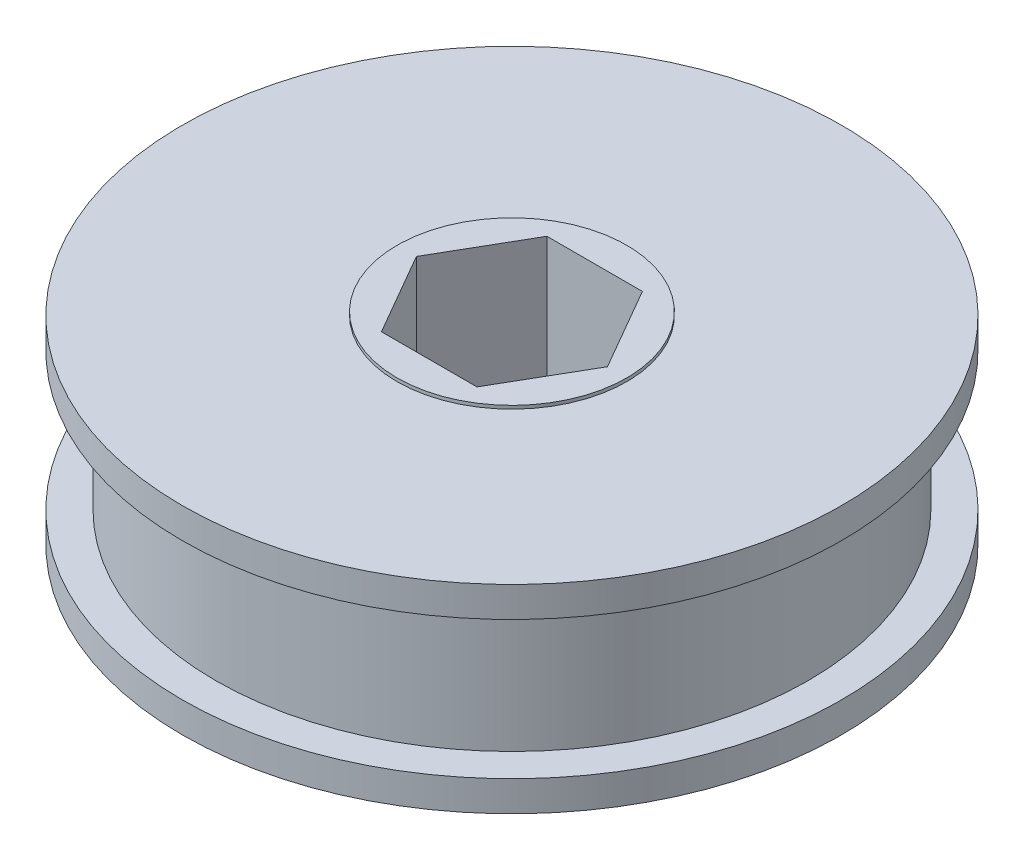
ISO-10303-21;
HEADER;
FILE_DESCRIPTION(('STEP AP214'),'2;1');
FILE_NAME('part.step','',(''),(''),'','','');
FILE_SCHEMA(('AUTOMOTIVE_DESIGN { 1 0 10303 214 1 1 1 1 }'));
ENDSEC;
DATA;
#1=APPLICATION_CONTEXT('core data for automotive mechanical design processes');
#2=APPLICATION_PROTOCOL_DEFINITION('international standard','automotive_design',2000,#1);
#3=PRODUCT_CONTEXT('',#1,'mechanical');
#4=PRODUCT('Part','Part','',(#3));
#5=PRODUCT_RELATED_PRODUCT_CATEGORY('part','',(#4));
#6=PRODUCT_DEFINITION_FORMATION('','',#4);
#7=PRODUCT_DEFINITION_CONTEXT('part definition',#1,'design');
#8=PRODUCT_DEFINITION('design','',#6,#7);
#9=PRODUCT_DEFINITION_SHAPE('','',#8);
#10=(LENGTH_UNIT() NAMED_UNIT(*) SI_UNIT(.MILLI.,.METRE.));
#11=(NAMED_UNIT(*) PLANE_ANGLE_UNIT() SI_UNIT($,.RADIAN.));
#12=(NAMED_UNIT(*) SI_UNIT($,.STERADIAN.) SOLID_ANGLE_UNIT());
#13=UNCERTAINTY_MEASURE_WITH_UNIT(LENGTH_MEASURE(1.E-05),#10,'distance_accuracy_value','');
#14=(GEOMETRIC_REPRESENTATION_CONTEXT(3) GLOBAL_UNCERTAINTY_ASSIGNED_CONTEXT((#13)) GLOBAL_UNIT_ASSIGNED_CONTEXT((#10,
#11,#12)) REPRESENTATION_CONTEXT('',''));
#15=CARTESIAN_POINT('',(0.,0.,0.));
#16=DIRECTION('',(0.,0.,1.));
#17=DIRECTION('',(1.,0.,0.));
#18=AXIS2_PLACEMENT_3D('',#15,#16,#17);
#19=CARTESIAN_POINT('',(0.,-3.2131,-2.53999999999999));
#20=DIRECTION('',(0.,-1.,0.));
#21=DIRECTION('',(0.,0.,-1.));
#22=AXIS2_PLACEMENT_3D('',#19,#20,#21);
#23=PLANE('',#22);
#24=DIRECTION('',(1.,0.,0.));
#25=VECTOR('',#24,1.);
#26=CARTESIAN_POINT('',(0.,-3.2131,-6.4008));
#27=LINE('',#26,#25);
#28=CARTESIAN_POINT('',(-3.69550360302896,-3.2131,-6.4008));
#29=VERTEX_POINT('',#28);
#30=CARTESIAN_POINT('',(3.69550360302896,-3.2131,-6.4008));
#31=VERTEX_POINT('',#30);
#32=EDGE_CURVE('E115',#29,#31,#27,.T.);
#33=ORIENTED_EDGE('',*,*,#32,.T.);
#34=DIRECTION('',(0.5,0.,0.866025403784439));
#35=VECTOR('',#34,1.);
#36=CARTESIAN_POINT('',(4.4434031417372,-3.2131,-5.1054));
#37=LINE('',#36,#35);
#38=CARTESIAN_POINT('',(7.39100720605792,-3.2131,0.));
#39=VERTEX_POINT('',#38);
#40=EDGE_CURVE('E90',#31,#39,#37,.T.);
#41=ORIENTED_EDGE('',*,*,#40,.T.);
#42=DIRECTION('',(-0.5,0.,0.866025403784439));
#43=VECTOR('',#42,1.);
#44=CARTESIAN_POINT('',(6.64310766734967,-3.2131,1.29540000000001));
#45=LINE('',#44,#43);
#46=CARTESIAN_POINT('',(3.69550360302896,-3.2131,6.4008));
#47=VERTEX_POINT('',#46);
#48=EDGE_CURVE('E136',#39,#47,#45,.T.);
#49=ORIENTED_EDGE('',*,*,#48,.T.);
#50=DIRECTION('',(-1.,0.,0.));
#51=VECTOR('',#50,1.);
#52=CARTESIAN_POINT('',(0.,-3.2131,6.4008));
#53=LINE('',#52,#51);
#54=CARTESIAN_POINT('',(-3.69550360302896,-3.2131,6.4008));
#55=VERTEX_POINT('',#54);
#56=EDGE_CURVE('E133',#47,#55,#53,.T.);
#57=ORIENTED_EDGE('',*,*,#56,.T.);
#58=DIRECTION('',(-0.5,0.,-0.866025403784439));
#59=VECTOR('',#58,1.);
#60=CARTESIAN_POINT('',(-6.64310766734967,-3.2131,1.29540000000001));
#61=LINE('',#60,#59);
#62=CARTESIAN_POINT('',(-7.39100720605791,-3.2131,0.));
#63=VERTEX_POINT('',#62);
#64=EDGE_CURVE('E130',#55,#63,#61,.T.);
#65=ORIENTED_EDGE('',*,*,#64,.T.);
#66=DIRECTION('',(0.5,0.,-0.866025403784439));
#67=VECTOR('',#66,1.);
#68=CARTESIAN_POINT('',(-4.4434031417372,-3.2131,-5.1054));
#69=LINE('',#68,#67);
#70=EDGE_CURVE('E127',#63,#29,#69,.T.);
#71=ORIENTED_EDGE('',*,*,#70,.T.);
#72=EDGE_LOOP('',(#33,#41,#49,#57,#65,#71));
#73=FACE_BOUND('',#72,.T.);
#74=CARTESIAN_POINT('',(0.,-3.2131,0.));
#75=DIRECTION('',(0.,1.,0.));
#76=DIRECTION('',(0.,0.,1.));
#77=AXIS2_PLACEMENT_3D('',#74,#75,#76);
#78=CIRCLE('',#77,8.89);
#79=CARTESIAN_POINT('',(0.,-3.2131,8.89));
#80=VERTEX_POINT('',#79);
#81=EDGE_CURVE('E11',#80,#80,#78,.T.);
#82=ORIENTED_EDGE('',*,*,#81,.T.);
#83=EDGE_LOOP('',(#82));
#84=FACE_BOUND('',#83,.T.);
#85=ADVANCED_FACE('F32',(#73,#84),#23,.F.);
#86=CARTESIAN_POINT('',(0.,55.,0.));
#87=DIRECTION('',(0.,1.,0.));
#88=DIRECTION('',(0.,0.,1.));
#89=AXIS2_PLACEMENT_3D('',#86,#87,#88);
#90=CYLINDRICAL_SURFACE('',#89,8.89);
#91=ORIENTED_EDGE('',*,*,#81,.F.);
#92=EDGE_LOOP('',(#91));
#93=FACE_BOUND('',#92,.T.);
#94=CARTESIAN_POINT('',(0.,-3.4671,0.));
#95=DIRECTION('',(0.,1.,0.));
#96=DIRECTION('',(0.,0.,1.));
#97=AXIS2_PLACEMENT_3D('',#94,#95,#96);
#98=CIRCLE('',#97,8.89);
#99=CARTESIAN_POINT('',(0.,-3.4671,8.89));
#100=VERTEX_POINT('',#99);
#101=EDGE_CURVE('E39',#100,#100,#98,.T.);
#102=ORIENTED_EDGE('',*,*,#101,.T.);
#103=EDGE_LOOP('',(#102));
#104=FACE_BOUND('',#103,.T.);
#105=ADVANCED_FACE('F166',(#93,#104),#90,.T.);
#106=CARTESIAN_POINT('',(0.,-3.4671,-8.89));
#107=DIRECTION('',(0.,-1.,0.));
#108=DIRECTION('',(0.,0.,-1.));
#109=AXIS2_PLACEMENT_3D('',#106,#107,#108);
#110=PLANE('',#109);
#111=ORIENTED_EDGE('',*,*,#101,.F.);
#112=EDGE_LOOP('',(#111));
#113=FACE_BOUND('',#112,.T.);
#114=CARTESIAN_POINT('',(0.,-3.46710000000001,0.));
#115=DIRECTION('',(0.,1.,0.));
#116=DIRECTION('',(0.,0.,1.));
#117=AXIS2_PLACEMENT_3D('',#114,#115,#116);
#118=CIRCLE('',#117,25.5016);
#119=CARTESIAN_POINT('',(0.,-3.46710000000001,25.5016));
#120=VERTEX_POINT('',#119);
#121=EDGE_CURVE('E161',#120,#120,#118,.T.);
#122=ORIENTED_EDGE('',*,*,#121,.T.);
#123=EDGE_LOOP('',(#122));
#124=FACE_BOUND('',#123,.T.);
#125=ADVANCED_FACE('F168',(#113,#124),#110,.F.);
#126=CARTESIAN_POINT('',(0.,55.,0.));
#127=DIRECTION('',(0.,1.,0.));
#128=DIRECTION('',(0.,0.,1.));
#129=AXIS2_PLACEMENT_3D('',#126,#127,#128);
#130=CYLINDRICAL_SURFACE('',#129,25.5016);
#131=ORIENTED_EDGE('',*,*,#121,.F.);
#132=EDGE_LOOP('',(#131));
#133=FACE_BOUND('',#132,.T.);
#134=CARTESIAN_POINT('',(0.,-5.8166,0.));
#135=DIRECTION('',(0.,1.,0.));
#136=DIRECTION('',(0.,0.,1.));
#137=AXIS2_PLACEMENT_3D('',#134,#135,#136);
#138=CIRCLE('',#137,25.5016);
#139=CARTESIAN_POINT('',(0.,-5.8166,25.5016));
#140=VERTEX_POINT('',#139);
#141=EDGE_CURVE('E158',#140,#140,#138,.T.);
#142=ORIENTED_EDGE('',*,*,#141,.T.);
#143=EDGE_LOOP('',(#142));
#144=FACE_BOUND('',#143,.T.);
#145=ADVANCED_FACE('F171',(#133,#144),#130,.T.);
#146=CARTESIAN_POINT('',(0.,-5.8166,-22.9235));
#147=DIRECTION('',(0.,1.,0.));
#148=DIRECTION('',(0.,0.,1.));
#149=AXIS2_PLACEMENT_3D('',#146,#147,#148);
#150=PLANE('',#149);
#151=ORIENTED_EDGE('',*,*,#141,.F.);
#152=EDGE_LOOP('',(#151));
#153=FACE_BOUND('',#152,.T.);
#154=CARTESIAN_POINT('',(0.,-5.8166,0.));
#155=DIRECTION('',(0.,1.,0.));
#156=DIRECTION('',(0.,0.,1.));
#157=AXIS2_PLACEMENT_3D('',#154,#155,#156);
#158=CIRCLE('',#157,22.9235);
#159=CARTESIAN_POINT('',(0.,-5.8166,22.9235));
#160=VERTEX_POINT('',#159);
#161=EDGE_CURVE('E155',#160,#160,#158,.T.);
#162=ORIENTED_EDGE('',*,*,#161,.T.);
#163=EDGE_LOOP('',(#162));
#164=FACE_BOUND('',#163,.T.);
#165=ADVANCED_FACE('F177',(#153,#164),#150,.F.);
#166=CARTESIAN_POINT('',(0.,55.,0.));
#167=DIRECTION('',(0.,1.,0.));
#168=DIRECTION('',(0.,0.,1.));
#169=AXIS2_PLACEMENT_3D('',#166,#167,#168);
#170=CYLINDRICAL_SURFACE('',#169,22.9235);
#171=ORIENTED_EDGE('',*,*,#161,.F.);
#172=EDGE_LOOP('',(#171));
#173=FACE_BOUND('',#172,.T.);
#174=CARTESIAN_POINT('',(0.,-16.4846,0.));
#175=DIRECTION('',(0.,1.,0.));
#176=DIRECTION('',(0.,0.,1.));
#177=AXIS2_PLACEMENT_3D('',#174,#175,#176);
#178=CIRCLE('',#177,22.9235);
#179=CARTESIAN_POINT('',(0.,-16.4846,22.9235));
#180=VERTEX_POINT('',#179);
#181=EDGE_CURVE('E152',#180,#180,#178,.T.);
#182=ORIENTED_EDGE('',*,*,#181,.T.);
#183=EDGE_LOOP('',(#182));
#184=FACE_BOUND('',#183,.T.);
#185=ADVANCED_FACE('F183',(#173,#184),#170,.T.);
#186=CARTESIAN_POINT('',(0.,-16.4846,-22.9235));
#187=DIRECTION('',(0.,-1.,0.));
#188=DIRECTION('',(0.,0.,-1.));
#189=AXIS2_PLACEMENT_3D('',#186,#187,#188);
#190=PLANE('',#189);
#191=ORIENTED_EDGE('',*,*,#181,.F.);
#192=EDGE_LOOP('',(#191));
#193=FACE_BOUND('',#192,.T.);
#194=CARTESIAN_POINT('',(0.,-16.4846,0.));
#195=DIRECTION('',(0.,1.,0.));
#196=DIRECTION('',(0.,0.,1.));
#197=AXIS2_PLACEMENT_3D('',#194,#195,#196);
#198=CIRCLE('',#197,25.5016);
#199=CARTESIAN_POINT('',(0.,-16.4846,25.5016));
#200=VERTEX_POINT('',#199);
#201=EDGE_CURVE('E149',#200,#200,#198,.T.);
#202=ORIENTED_EDGE('',*,*,#201,.T.);
#203=EDGE_LOOP('',(#202));
#204=FACE_BOUND('',#203,.T.);
#205=ADVANCED_FACE('F189',(#193,#204),#190,.F.);
#206=CARTESIAN_POINT('',(0.,55.,0.));
#207=DIRECTION('',(0.,1.,0.));
#208=DIRECTION('',(0.,0.,1.));
#209=AXIS2_PLACEMENT_3D('',#206,#207,#208);
#210=CYLINDRICAL_SURFACE('',#209,25.5016);
#211=ORIENTED_EDGE('',*,*,#201,.F.);
#212=EDGE_LOOP('',(#211));
#213=FACE_BOUND('',#212,.T.);
#214=CARTESIAN_POINT('',(0.,-18.8341,0.));
#215=DIRECTION('',(0.,1.,0.));
#216=DIRECTION('',(0.,0.,1.));
#217=AXIS2_PLACEMENT_3D('',#214,#215,#216);
#218=CIRCLE('',#217,25.5016);
#219=CARTESIAN_POINT('',(0.,-18.8341,25.5016));
#220=VERTEX_POINT('',#219);
#221=EDGE_CURVE('E146',#220,#220,#218,.T.);
#222=ORIENTED_EDGE('',*,*,#221,.T.);
#223=EDGE_LOOP('',(#222));
#224=FACE_BOUND('',#223,.T.);
#225=ADVANCED_FACE('F195',(#213,#224),#210,.T.);
#226=CARTESIAN_POINT('',(0.,-18.8341,-25.5016));
#227=DIRECTION('',(0.,1.,0.));
#228=DIRECTION('',(0.,0.,1.));
#229=AXIS2_PLACEMENT_3D('',#226,#227,#228);
#230=PLANE('',#229);
#231=ORIENTED_EDGE('',*,*,#221,.F.);
#232=EDGE_LOOP('',(#231));
#233=FACE_BOUND('',#232,.T.);
#234=CARTESIAN_POINT('',(0.,-18.8341,0.));
#235=DIRECTION('',(0.,1.,0.));
#236=DIRECTION('',(0.,0.,1.));
#237=AXIS2_PLACEMENT_3D('',#234,#235,#236);
#238=CIRCLE('',#237,8.89);
#239=CARTESIAN_POINT('',(0.,-18.8341,8.89));
#240=VERTEX_POINT('',#239);
#241=EDGE_CURVE('E143',#240,#240,#238,.T.);
#242=ORIENTED_EDGE('',*,*,#241,.T.);
#243=EDGE_LOOP('',(#242));
#244=FACE_BOUND('',#243,.T.);
#245=ADVANCED_FACE('F201',(#233,#244),#230,.F.);
#246=CARTESIAN_POINT('',(0.,55.,0.));
#247=DIRECTION('',(0.,1.,0.));
#248=DIRECTION('',(0.,0.,1.));
#249=AXIS2_PLACEMENT_3D('',#246,#247,#248);
#250=CYLINDRICAL_SURFACE('',#249,8.89);
#251=ORIENTED_EDGE('',*,*,#241,.F.);
#252=EDGE_LOOP('',(#251));
#253=FACE_BOUND('',#252,.T.);
#254=CARTESIAN_POINT('',(0.,-19.0881,0.));
#255=DIRECTION('',(0.,1.,0.));
#256=DIRECTION('',(0.,0.,1.));
#257=AXIS2_PLACEMENT_3D('',#254,#255,#256);
#258=CIRCLE('',#257,8.89);
#259=CARTESIAN_POINT('',(0.,-19.0881,8.89));
#260=VERTEX_POINT('',#259);
#261=EDGE_CURVE('E140',#260,#260,#258,.T.);
#262=ORIENTED_EDGE('',*,*,#261,.T.);
#263=EDGE_LOOP('',(#262));
#264=FACE_BOUND('',#263,.T.);
#265=ADVANCED_FACE('F207',(#253,#264),#250,.T.);
#266=CARTESIAN_POINT('',(0.,-19.0881,-8.89));
#267=DIRECTION('',(0.,1.,0.));
#268=DIRECTION('',(0.,0.,1.));
#269=AXIS2_PLACEMENT_3D('',#266,#267,#268);
#270=PLANE('',#269);
#271=DIRECTION('',(0.5,0.,-0.866025403784438));
#272=VECTOR('',#271,1.);
#273=CARTESIAN_POINT('',(3.69550360302896,-19.0881,6.4008));
#274=LINE('',#273,#272);
#275=CARTESIAN_POINT('',(3.69550360302896,-19.0881,6.4008));
#276=VERTEX_POINT('',#275);
#277=CARTESIAN_POINT('',(7.39100720605792,-19.0881,0.));
#278=VERTEX_POINT('',#277);
#279=EDGE_CURVE('E93',#276,#278,#274,.T.);
#280=ORIENTED_EDGE('',*,*,#279,.T.);
#281=DIRECTION('',(-0.5,0.,-0.866025403784438));
#282=VECTOR('',#281,1.);
#283=CARTESIAN_POINT('',(7.39100720605792,-19.0881,0.));
#284=LINE('',#283,#282);
#285=CARTESIAN_POINT('',(3.69550360302896,-19.0881,-6.4008));
#286=VERTEX_POINT('',#285);
#287=EDGE_CURVE('E87',#278,#286,#284,.T.);
#288=ORIENTED_EDGE('',*,*,#287,.T.);
#289=DIRECTION('',(-1.,0.,0.));
#290=VECTOR('',#289,1.);
#291=CARTESIAN_POINT('',(3.69550360302896,-19.0881,-6.4008));
#292=LINE('',#291,#290);
#293=CARTESIAN_POINT('',(-3.69550360302896,-19.0881,-6.4008));
#294=VERTEX_POINT('',#293);
#295=EDGE_CURVE('E96',#286,#294,#292,.T.);
#296=ORIENTED_EDGE('',*,*,#295,.T.);
#297=DIRECTION('',(-0.5,0.,0.866025403784439));
#298=VECTOR('',#297,1.);
#299=CARTESIAN_POINT('',(-3.69550360302896,-19.0881,-6.4008));
#300=LINE('',#299,#298);
#301=CARTESIAN_POINT('',(-7.39100720605791,-19.0881,0.));
#302=VERTEX_POINT('',#301);
#303=EDGE_CURVE('E54',#294,#302,#300,.T.);
#304=ORIENTED_EDGE('',*,*,#303,.T.);
#305=DIRECTION('',(0.5,0.,0.866025403784439));
#306=VECTOR('',#305,1.);
#307=CARTESIAN_POINT('',(-7.39100720605791,-19.0881,0.));
#308=LINE('',#307,#306);
#309=CARTESIAN_POINT('',(-3.69550360302896,-19.0881,6.4008));
#310=VERTEX_POINT('',#309);
#311=EDGE_CURVE('E107',#302,#310,#308,.T.);
#312=ORIENTED_EDGE('',*,*,#311,.T.);
#313=DIRECTION('',(1.,0.,0.));
#314=VECTOR('',#313,1.);
#315=CARTESIAN_POINT('',(-3.69550360302896,-19.0881,6.4008));
#316=LINE('',#315,#314);
#317=EDGE_CURVE('E110',#310,#276,#316,.T.);
#318=ORIENTED_EDGE('',*,*,#317,.T.);
#319=EDGE_LOOP('',(#280,#288,#296,#304,#312,#318));
#320=FACE_BOUND('',#319,.T.);
#321=ORIENTED_EDGE('',*,*,#261,.F.);
#322=EDGE_LOOP('',(#321));
#323=FACE_BOUND('',#322,.T.);
#324=ADVANCED_FACE('F100',(#320,#323),#270,.F.);
#325=CARTESIAN_POINT('',(7.39100720605792,-19.0881,0.));
#326=DIRECTION('',(0.866025403784438,0.,-0.5));
#327=DIRECTION('',(-0.5,0.,-0.866025403784439));
#328=AXIS2_PLACEMENT_3D('',#325,#326,#327);
#329=PLANE('',#328);
#330=DIRECTION('',(0.,1.,0.));
#331=VECTOR('',#330,1.);
#332=CARTESIAN_POINT('',(3.69550360302896,-19.0881,-6.4008));
#333=LINE('',#332,#331);
#334=EDGE_CURVE('E46',#286,#31,#333,.T.);
#335=ORIENTED_EDGE('',*,*,#334,.F.);
#336=ORIENTED_EDGE('',*,*,#287,.F.);
#337=DIRECTION('',(0.,1.,0.));
#338=VECTOR('',#337,1.);
#339=CARTESIAN_POINT('',(7.39100720605792,-19.0881,0.));
#340=LINE('',#339,#338);
#341=EDGE_CURVE('E113',#278,#39,#340,.T.);
#342=ORIENTED_EDGE('',*,*,#341,.T.);
#343=ORIENTED_EDGE('',*,*,#40,.F.);
#344=EDGE_LOOP('',(#335,#336,#342,#343));
#345=FACE_BOUND('',#344,.T.);
#346=ADVANCED_FACE('F84',(#345),#329,.F.);
#347=CARTESIAN_POINT('',(3.69550360302896,-19.0881,6.4008));
#348=DIRECTION('',(0.866025403784438,0.,0.5));
#349=DIRECTION('',(0.5,0.,-0.866025403784439));
#350=AXIS2_PLACEMENT_3D('',#347,#348,#349);
#351=PLANE('',#350);
#352=ORIENTED_EDGE('',*,*,#341,.F.);
#353=ORIENTED_EDGE('',*,*,#279,.F.);
#354=DIRECTION('',(0.,1.,0.));
#355=VECTOR('',#354,1.);
#356=CARTESIAN_POINT('',(3.69550360302896,-19.0881,6.4008));
#357=LINE('',#356,#355);
#358=EDGE_CURVE('E116',#276,#47,#357,.T.);
#359=ORIENTED_EDGE('',*,*,#358,.T.);
#360=ORIENTED_EDGE('',*,*,#48,.F.);
#361=EDGE_LOOP('',(#352,#353,#359,#360));
#362=FACE_BOUND('',#361,.T.);
#363=ADVANCED_FACE('F220',(#362),#351,.F.);
#364=CARTESIAN_POINT('',(-3.69550360302896,-19.0881,6.4008));
#365=DIRECTION('',(0.,0.,1.));
#366=DIRECTION('',(1.,0.,0.));
#367=AXIS2_PLACEMENT_3D('',#364,#365,#366);
#368=PLANE('',#367);
#369=ORIENTED_EDGE('',*,*,#358,.F.);
#370=ORIENTED_EDGE('',*,*,#317,.F.);
#371=DIRECTION('',(0.,1.,0.));
#372=VECTOR('',#371,1.);
#373=CARTESIAN_POINT('',(-3.69550360302896,-19.0881,6.4008));
#374=LINE('',#373,#372);
#375=EDGE_CURVE('E119',#310,#55,#374,.T.);
#376=ORIENTED_EDGE('',*,*,#375,.T.);
#377=ORIENTED_EDGE('',*,*,#56,.F.);
#378=EDGE_LOOP('',(#369,#370,#376,#377));
#379=FACE_BOUND('',#378,.T.);
#380=ADVANCED_FACE('F235',(#379),#368,.F.);
#381=CARTESIAN_POINT('',(-7.39100720605791,-19.0881,0.));
#382=DIRECTION('',(-0.866025403784439,0.,0.5));
#383=DIRECTION('',(0.5,0.,0.866025403784439));
#384=AXIS2_PLACEMENT_3D('',#381,#382,#383);
#385=PLANE('',#384);
#386=ORIENTED_EDGE('',*,*,#375,.F.);
#387=ORIENTED_EDGE('',*,*,#311,.F.);
#388=DIRECTION('',(0.,1.,0.));
#389=VECTOR('',#388,1.);
#390=CARTESIAN_POINT('',(-7.39100720605791,-19.0881,0.));
#391=LINE('',#390,#389);
#392=EDGE_CURVE('E122',#302,#63,#391,.T.);
#393=ORIENTED_EDGE('',*,*,#392,.T.);
#394=ORIENTED_EDGE('',*,*,#64,.F.);
#395=EDGE_LOOP('',(#386,#387,#393,#394));
#396=FACE_BOUND('',#395,.T.);
#397=ADVANCED_FACE('F233',(#396),#385,.F.);
#398=CARTESIAN_POINT('',(-3.69550360302896,-19.0881,-6.4008));
#399=DIRECTION('',(-0.866025403784439,0.,-0.5));
#400=DIRECTION('',(-0.5,0.,0.866025403784439));
#401=AXIS2_PLACEMENT_3D('',#398,#399,#400);
#402=PLANE('',#401);
#403=ORIENTED_EDGE('',*,*,#392,.F.);
#404=ORIENTED_EDGE('',*,*,#303,.F.);
#405=DIRECTION('',(0.,1.,0.));
#406=VECTOR('',#405,1.);
#407=CARTESIAN_POINT('',(-3.69550360302896,-19.0881,-6.4008));
#408=LINE('',#407,#406);
#409=EDGE_CURVE('E92',#294,#29,#408,.T.);
#410=ORIENTED_EDGE('',*,*,#409,.T.);
#411=ORIENTED_EDGE('',*,*,#70,.F.);
#412=EDGE_LOOP('',(#403,#404,#410,#411));
#413=FACE_BOUND('',#412,.T.);
#414=ADVANCED_FACE('F230',(#413),#402,.F.);
#415=CARTESIAN_POINT('',(3.69550360302896,-19.0881,-6.4008));
#416=DIRECTION('',(0.,0.,-1.));
#417=DIRECTION('',(-1.,0.,0.));
#418=AXIS2_PLACEMENT_3D('',#415,#416,#417);
#419=PLANE('',#418);
#420=ORIENTED_EDGE('',*,*,#409,.F.);
#421=ORIENTED_EDGE('',*,*,#295,.F.);
#422=ORIENTED_EDGE('',*,*,#334,.T.);
#423=ORIENTED_EDGE('',*,*,#32,.F.);
#424=EDGE_LOOP('',(#420,#421,#422,#423));
#425=FACE_BOUND('',#424,.T.);
#426=ADVANCED_FACE('F97',(#425),#419,.F.);
#427=CLOSED_SHELL('',(#85,#105,#125,#145,#165,#185,#205,#225,#245,#265,#324,#346,#363,#380,#397,
#414,#426));
#428=MANIFOLD_SOLID_BREP('B2',#427);
#429=ADVANCED_BREP_SHAPE_REPRESENTATION('',(#18,#428),#14);
#430=SHAPE_DEFINITION_REPRESENTATION(#9,#429);
ENDSEC;
END-ISO-10303-21;
